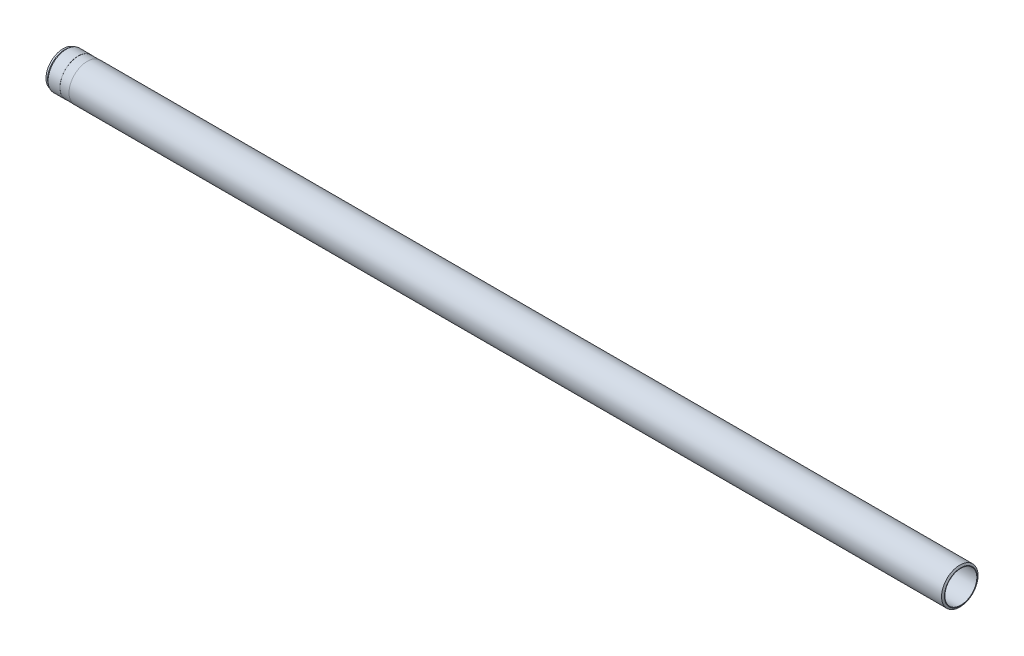
ISO-10303-21;
HEADER;
FILE_DESCRIPTION(('STEP AP214'),'2;1');
FILE_NAME('part.step','',(''),(''),'','','');
FILE_SCHEMA(('AUTOMOTIVE_DESIGN { 1 0 10303 214 1 1 1 1 }'));
ENDSEC;
DATA;
#1=APPLICATION_CONTEXT('core data for automotive mechanical design processes');
#2=APPLICATION_PROTOCOL_DEFINITION('international standard','automotive_design',2000,#1);
#3=PRODUCT_CONTEXT('',#1,'mechanical');
#4=PRODUCT('Part','Part','',(#3));
#5=PRODUCT_RELATED_PRODUCT_CATEGORY('part','',(#4));
#6=PRODUCT_DEFINITION_FORMATION('','',#4);
#7=PRODUCT_DEFINITION_CONTEXT('part definition',#1,'design');
#8=PRODUCT_DEFINITION('design','',#6,#7);
#9=PRODUCT_DEFINITION_SHAPE('','',#8);
#10=(LENGTH_UNIT() NAMED_UNIT(*) SI_UNIT(.MILLI.,.METRE.));
#11=(NAMED_UNIT(*) PLANE_ANGLE_UNIT() SI_UNIT($,.RADIAN.));
#12=(NAMED_UNIT(*) SI_UNIT($,.STERADIAN.) SOLID_ANGLE_UNIT());
#13=UNCERTAINTY_MEASURE_WITH_UNIT(LENGTH_MEASURE(1.E-05),#10,'distance_accuracy_value','');
#14=(GEOMETRIC_REPRESENTATION_CONTEXT(3) GLOBAL_UNCERTAINTY_ASSIGNED_CONTEXT((#13)) GLOBAL_UNIT_ASSIGNED_CONTEXT((#10,
#11,#12)) REPRESENTATION_CONTEXT('',''));
#15=CARTESIAN_POINT('',(0.,0.,0.));
#16=DIRECTION('',(0.,0.,1.));
#17=DIRECTION('',(1.,0.,0.));
#18=AXIS2_PLACEMENT_3D('',#15,#16,#17);
#19=CARTESIAN_POINT('',(0.,0.,0.));
#20=DIRECTION('',(-1.,0.,0.));
#21=DIRECTION('',(0.,0.,1.));
#22=AXIS2_PLACEMENT_3D('',#19,#20,#21);
#23=CONICAL_SURFACE('',#22,36.,1.0471975511966);
#24=CARTESIAN_POINT('',(-2.30940107675849,0.,0.));
#25=DIRECTION('',(-1.,0.,0.));
#26=DIRECTION('',(0.,0.,1.));
#27=AXIS2_PLACEMENT_3D('',#24,#25,#26);
#28=CIRCLE('',#27,40.);
#29=CARTESIAN_POINT('',(-2.30940107675849,0.,40.));
#30=VERTEX_POINT('',#29);
#31=EDGE_CURVE('E10',#30,#30,#28,.T.);
#32=ORIENTED_EDGE('',*,*,#31,.F.);
#33=EDGE_LOOP('',(#32));
#34=FACE_BOUND('',#33,.T.);
#35=CARTESIAN_POINT('',(0.,0.,0.));
#36=DIRECTION('',(-1.,0.,0.));
#37=DIRECTION('',(0.,0.,1.));
#38=AXIS2_PLACEMENT_3D('',#35,#36,#37);
#39=CIRCLE('',#38,36.);
#40=CARTESIAN_POINT('',(0.,0.,36.));
#41=VERTEX_POINT('',#40);
#42=EDGE_CURVE('E83',#41,#41,#39,.T.);
#43=ORIENTED_EDGE('',*,*,#42,.T.);
#44=EDGE_LOOP('',(#43));
#45=FACE_BOUND('',#44,.T.);
#46=ADVANCED_FACE('F37',(#34,#45),#23,.T.);
#47=CARTESIAN_POINT('',(-122.784188741722,0.,0.));
#48=DIRECTION('',(-1.,0.,0.));
#49=DIRECTION('',(0.,0.,1.));
#50=AXIS2_PLACEMENT_3D('',#47,#48,#49);
#51=CYLINDRICAL_SURFACE('',#50,39.9999999999999);
#52=CARTESIAN_POINT('',(-1915.,0.,0.));
#53=DIRECTION('',(-1.,0.,0.));
#54=DIRECTION('',(0.,0.,1.));
#55=AXIS2_PLACEMENT_3D('',#52,#53,#54);
#56=CIRCLE('',#55,39.9999999999998);
#57=CARTESIAN_POINT('',(-1915.,0.,39.9999999999998));
#58=VERTEX_POINT('',#57);
#59=EDGE_CURVE('E43',#58,#58,#56,.T.);
#60=ORIENTED_EDGE('',*,*,#59,.F.);
#61=EDGE_LOOP('',(#60));
#62=FACE_BOUND('',#61,.T.);
#63=ORIENTED_EDGE('',*,*,#31,.T.);
#64=EDGE_LOOP('',(#63));
#65=FACE_BOUND('',#64,.T.);
#66=ADVANCED_FACE('F156',(#62,#65),#51,.T.);
#67=CARTESIAN_POINT('',(-1915.,39.9999999999998,0.));
#68=DIRECTION('',(1.,0.,0.));
#69=DIRECTION('',(0.,0.,-1.));
#70=AXIS2_PLACEMENT_3D('',#67,#68,#69);
#71=PLANE('',#70);
#72=CARTESIAN_POINT('',(-1915.,0.,0.));
#73=DIRECTION('',(-1.,0.,0.));
#74=DIRECTION('',(0.,0.,1.));
#75=AXIS2_PLACEMENT_3D('',#72,#73,#74);
#76=CIRCLE('',#75,39.75);
#77=CARTESIAN_POINT('',(-1915.,0.,39.75));
#78=VERTEX_POINT('',#77);
#79=EDGE_CURVE('E47',#78,#78,#76,.T.);
#80=ORIENTED_EDGE('',*,*,#79,.F.);
#81=EDGE_LOOP('',(#80));
#82=FACE_BOUND('',#81,.T.);
#83=ORIENTED_EDGE('',*,*,#59,.T.);
#84=EDGE_LOOP('',(#83));
#85=FACE_BOUND('',#84,.T.);
#86=ADVANCED_FACE('F151',(#82,#85),#71,.F.);
#87=CARTESIAN_POINT('',(-122.784188741722,0.,0.));
#88=DIRECTION('',(-1.,0.,0.));
#89=DIRECTION('',(0.,0.,1.));
#90=AXIS2_PLACEMENT_3D('',#87,#88,#89);
#91=CYLINDRICAL_SURFACE('',#90,39.75);
#92=CARTESIAN_POINT('',(-1935.,0.,0.));
#93=DIRECTION('',(-1.,0.,0.));
#94=DIRECTION('',(0.,0.,1.));
#95=AXIS2_PLACEMENT_3D('',#92,#93,#94);
#96=CIRCLE('',#95,39.75);
#97=CARTESIAN_POINT('',(-1935.,0.,39.75));
#98=VERTEX_POINT('',#97);
#99=EDGE_CURVE('E51',#98,#98,#96,.T.);
#100=ORIENTED_EDGE('',*,*,#99,.F.);
#101=EDGE_LOOP('',(#100));
#102=FACE_BOUND('',#101,.T.);
#103=ORIENTED_EDGE('',*,*,#79,.T.);
#104=EDGE_LOOP('',(#103));
#105=FACE_BOUND('',#104,.T.);
#106=ADVANCED_FACE('F145',(#102,#105),#91,.T.);
#107=CARTESIAN_POINT('',(-1935.,39.75,0.));
#108=DIRECTION('',(-1.,0.,0.));
#109=DIRECTION('',(0.,0.,1.));
#110=AXIS2_PLACEMENT_3D('',#107,#108,#109);
#111=PLANE('',#110);
#112=CARTESIAN_POINT('',(-1935.,0.,0.));
#113=DIRECTION('',(-1.,0.,0.));
#114=DIRECTION('',(0.,0.,1.));
#115=AXIS2_PLACEMENT_3D('',#112,#113,#114);
#116=CIRCLE('',#115,39.9999999999998);
#117=CARTESIAN_POINT('',(-1935.,0.,39.9999999999998));
#118=VERTEX_POINT('',#117);
#119=EDGE_CURVE('E56',#118,#118,#116,.T.);
#120=ORIENTED_EDGE('',*,*,#119,.F.);
#121=EDGE_LOOP('',(#120));
#122=FACE_BOUND('',#121,.T.);
#123=ORIENTED_EDGE('',*,*,#99,.T.);
#124=EDGE_LOOP('',(#123));
#125=FACE_BOUND('',#124,.T.);
#126=ADVANCED_FACE('F139',(#122,#125),#111,.F.);
#127=CARTESIAN_POINT('',(-122.784188741722,0.,0.));
#128=DIRECTION('',(-1.,0.,0.));
#129=DIRECTION('',(0.,0.,1.));
#130=AXIS2_PLACEMENT_3D('',#127,#128,#129);
#131=CYLINDRICAL_SURFACE('',#130,39.9999999999998);
#132=CARTESIAN_POINT('',(-1960.92962998315,0.,0.));
#133=DIRECTION('',(-1.,0.,0.));
#134=DIRECTION('',(0.,0.,1.));
#135=AXIS2_PLACEMENT_3D('',#132,#133,#134);
#136=CIRCLE('',#135,39.9999999999998);
#137=CARTESIAN_POINT('',(-1960.92962998315,0.,39.9999999999998));
#138=VERTEX_POINT('',#137);
#139=EDGE_CURVE('E59',#138,#138,#136,.T.);
#140=ORIENTED_EDGE('',*,*,#139,.F.);
#141=EDGE_LOOP('',(#140));
#142=FACE_BOUND('',#141,.T.);
#143=ORIENTED_EDGE('',*,*,#119,.T.);
#144=EDGE_LOOP('',(#143));
#145=FACE_BOUND('',#144,.T.);
#146=ADVANCED_FACE('F133',(#142,#145),#131,.T.);
#147=CARTESIAN_POINT('',(-1960.92962998315,0.,0.));
#148=DIRECTION('',(1.,0.,0.));
#149=DIRECTION('',(0.,0.,-1.));
#150=AXIS2_PLACEMENT_3D('',#147,#148,#149);
#151=CONICAL_SURFACE('',#150,39.9999999999998,0.610865238198037);
#152=CARTESIAN_POINT('',(-1964.5,0.,0.));
#153=DIRECTION('',(-1.,0.,0.));
#154=DIRECTION('',(0.,0.,1.));
#155=AXIS2_PLACEMENT_3D('',#152,#153,#154);
#156=CIRCLE('',#155,37.5);
#157=CARTESIAN_POINT('',(-1964.5,0.,37.5));
#158=VERTEX_POINT('',#157);
#159=EDGE_CURVE('E62',#158,#158,#156,.T.);
#160=ORIENTED_EDGE('',*,*,#159,.F.);
#161=EDGE_LOOP('',(#160));
#162=FACE_BOUND('',#161,.T.);
#163=ORIENTED_EDGE('',*,*,#139,.T.);
#164=EDGE_LOOP('',(#163));
#165=FACE_BOUND('',#164,.T.);
#166=ADVANCED_FACE('F127',(#162,#165),#151,.T.);
#167=CARTESIAN_POINT('',(-122.784188741722,0.,0.));
#168=DIRECTION('',(-1.,0.,0.));
#169=DIRECTION('',(0.,0.,1.));
#170=AXIS2_PLACEMENT_3D('',#167,#168,#169);
#171=CYLINDRICAL_SURFACE('',#170,37.5);
#172=CARTESIAN_POINT('',(-1968.,0.,0.));
#173=DIRECTION('',(-1.,0.,0.));
#174=DIRECTION('',(0.,0.,1.));
#175=AXIS2_PLACEMENT_3D('',#172,#173,#174);
#176=CIRCLE('',#175,37.5);
#177=CARTESIAN_POINT('',(-1968.,0.,37.5));
#178=VERTEX_POINT('',#177);
#179=EDGE_CURVE('E65',#178,#178,#176,.T.);
#180=ORIENTED_EDGE('',*,*,#179,.F.);
#181=EDGE_LOOP('',(#180));
#182=FACE_BOUND('',#181,.T.);
#183=ORIENTED_EDGE('',*,*,#159,.T.);
#184=EDGE_LOOP('',(#183));
#185=FACE_BOUND('',#184,.T.);
#186=ADVANCED_FACE('F121',(#182,#185),#171,.T.);
#187=CARTESIAN_POINT('',(-1968.,37.5,0.));
#188=DIRECTION('',(1.,0.,0.));
#189=DIRECTION('',(0.,0.,-1.));
#190=AXIS2_PLACEMENT_3D('',#187,#188,#189);
#191=PLANE('',#190);
#192=CARTESIAN_POINT('',(-1968.,0.,0.));
#193=DIRECTION('',(-1.,0.,0.));
#194=DIRECTION('',(0.,0.,1.));
#195=AXIS2_PLACEMENT_3D('',#192,#193,#194);
#196=CIRCLE('',#195,35.7273502691896);
#197=CARTESIAN_POINT('',(-1968.,0.,35.7273502691896));
#198=VERTEX_POINT('',#197);
#199=EDGE_CURVE('E68',#198,#198,#196,.T.);
#200=ORIENTED_EDGE('',*,*,#199,.F.);
#201=EDGE_LOOP('',(#200));
#202=FACE_BOUND('',#201,.T.);
#203=ORIENTED_EDGE('',*,*,#179,.T.);
#204=EDGE_LOOP('',(#203));
#205=FACE_BOUND('',#204,.T.);
#206=ADVANCED_FACE('F115',(#202,#205),#191,.F.);
#207=CARTESIAN_POINT('',(-1968.,0.,0.));
#208=DIRECTION('',(-1.,0.,0.));
#209=DIRECTION('',(0.,0.,1.));
#210=AXIS2_PLACEMENT_3D('',#207,#208,#209);
#211=CONICAL_SURFACE('',#210,35.7273502691896,0.5235987755983);
#212=CARTESIAN_POINT('',(-1967.,0.,0.));
#213=DIRECTION('',(-1.,0.,0.));
#214=DIRECTION('',(0.,0.,1.));
#215=AXIS2_PLACEMENT_3D('',#212,#213,#214);
#216=CIRCLE('',#215,35.15);
#217=CARTESIAN_POINT('',(-1967.,0.,35.15));
#218=VERTEX_POINT('',#217);
#219=EDGE_CURVE('E71',#218,#218,#216,.T.);
#220=ORIENTED_EDGE('',*,*,#219,.F.);
#221=EDGE_LOOP('',(#220));
#222=FACE_BOUND('',#221,.T.);
#223=ORIENTED_EDGE('',*,*,#199,.T.);
#224=EDGE_LOOP('',(#223));
#225=FACE_BOUND('',#224,.T.);
#226=ADVANCED_FACE('F109',(#222,#225),#211,.F.);
#227=CARTESIAN_POINT('',(-122.784188741722,0.,0.));
#228=DIRECTION('',(-1.,0.,0.));
#229=DIRECTION('',(0.,0.,1.));
#230=AXIS2_PLACEMENT_3D('',#227,#228,#229);
#231=CYLINDRICAL_SURFACE('',#230,35.15);
#232=CARTESIAN_POINT('',(-1953.,0.,0.));
#233=DIRECTION('',(-1.,0.,0.));
#234=DIRECTION('',(0.,0.,1.));
#235=AXIS2_PLACEMENT_3D('',#232,#233,#234);
#236=CIRCLE('',#235,35.15);
#237=CARTESIAN_POINT('',(-1953.,0.,35.15));
#238=VERTEX_POINT('',#237);
#239=EDGE_CURVE('E74',#238,#238,#236,.T.);
#240=ORIENTED_EDGE('',*,*,#239,.F.);
#241=EDGE_LOOP('',(#240));
#242=FACE_BOUND('',#241,.T.);
#243=ORIENTED_EDGE('',*,*,#219,.T.);
#244=EDGE_LOOP('',(#243));
#245=FACE_BOUND('',#244,.T.);
#246=ADVANCED_FACE('F103',(#242,#245),#231,.F.);
#247=CARTESIAN_POINT('',(-1953.,0.,0.));
#248=DIRECTION('',(-1.,0.,0.));
#249=DIRECTION('',(0.,0.,1.));
#250=AXIS2_PLACEMENT_3D('',#247,#248,#249);
#251=CONICAL_SURFACE('',#250,35.15,0.523598775598326);
#252=CARTESIAN_POINT('',(-1952.74019237886,0.,0.));
#253=DIRECTION('',(-1.,0.,0.));
#254=DIRECTION('',(0.,0.,1.));
#255=AXIS2_PLACEMENT_3D('',#252,#253,#254);
#256=CIRCLE('',#255,35.);
#257=CARTESIAN_POINT('',(-1952.74019237886,0.,35.));
#258=VERTEX_POINT('',#257);
#259=EDGE_CURVE('E77',#258,#258,#256,.T.);
#260=ORIENTED_EDGE('',*,*,#259,.F.);
#261=EDGE_LOOP('',(#260));
#262=FACE_BOUND('',#261,.T.);
#263=ORIENTED_EDGE('',*,*,#239,.T.);
#264=EDGE_LOOP('',(#263));
#265=FACE_BOUND('',#264,.T.);
#266=ADVANCED_FACE('F97',(#262,#265),#251,.F.);
#267=CARTESIAN_POINT('',(-122.784188741722,0.,0.));
#268=DIRECTION('',(-1.,0.,0.));
#269=DIRECTION('',(0.,0.,1.));
#270=AXIS2_PLACEMENT_3D('',#267,#268,#269);
#271=CYLINDRICAL_SURFACE('',#270,35.);
#272=CARTESIAN_POINT('',(0.,0.,0.));
#273=DIRECTION('',(-1.,0.,0.));
#274=DIRECTION('',(0.,0.,1.));
#275=AXIS2_PLACEMENT_3D('',#272,#273,#274);
#276=CIRCLE('',#275,35.);
#277=CARTESIAN_POINT('',(0.,0.,35.));
#278=VERTEX_POINT('',#277);
#279=EDGE_CURVE('E80',#278,#278,#276,.T.);
#280=ORIENTED_EDGE('',*,*,#279,.F.);
#281=EDGE_LOOP('',(#280));
#282=FACE_BOUND('',#281,.T.);
#283=ORIENTED_EDGE('',*,*,#259,.T.);
#284=EDGE_LOOP('',(#283));
#285=FACE_BOUND('',#284,.T.);
#286=ADVANCED_FACE('F91',(#282,#285),#271,.F.);
#287=CARTESIAN_POINT('',(0.,35.,0.));
#288=DIRECTION('',(-1.,0.,0.));
#289=DIRECTION('',(0.,0.,1.));
#290=AXIS2_PLACEMENT_3D('',#287,#288,#289);
#291=PLANE('',#290);
#292=ORIENTED_EDGE('',*,*,#42,.F.);
#293=EDGE_LOOP('',(#292));
#294=FACE_BOUND('',#293,.T.);
#295=ORIENTED_EDGE('',*,*,#279,.T.);
#296=EDGE_LOOP('',(#295));
#297=FACE_BOUND('',#296,.T.);
#298=ADVANCED_FACE('F88',(#294,#297),#291,.F.);
#299=CLOSED_SHELL('',(#46,#66,#86,#106,#126,#146,#166,#186,#206,#226,#246,#266,#286,#298));
#300=MANIFOLD_SOLID_BREP('B2',#299);
#301=ADVANCED_BREP_SHAPE_REPRESENTATION('',(#18,#300),#14);
#302=SHAPE_DEFINITION_REPRESENTATION(#9,#301);
ENDSEC;
END-ISO-10303-21;
